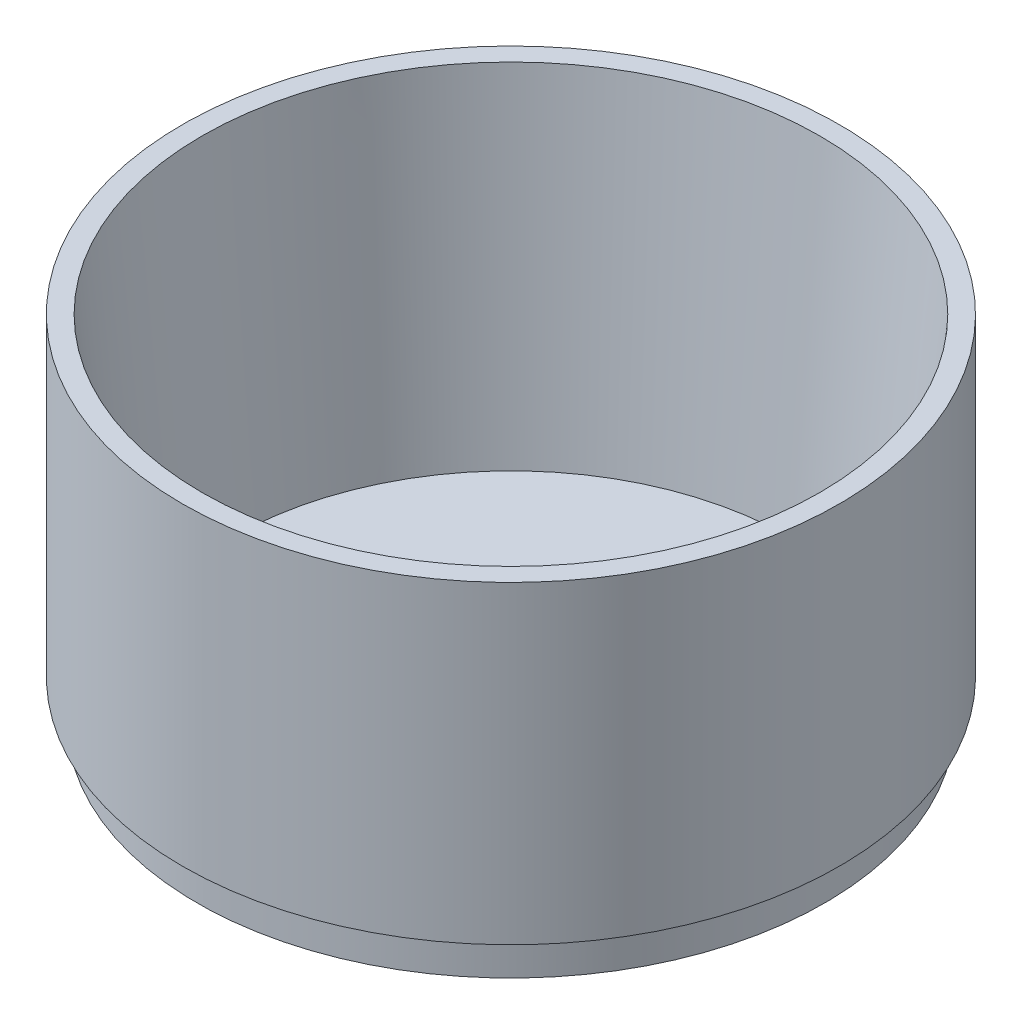
ISO-10303-21;
HEADER;
FILE_DESCRIPTION(('STEP AP214'),'2;1');
FILE_NAME('part.step','',(''),(''),'','','');
FILE_SCHEMA(('AUTOMOTIVE_DESIGN { 1 0 10303 214 1 1 1 1 }'));
ENDSEC;
DATA;
#1=APPLICATION_CONTEXT('core data for automotive mechanical design processes');
#2=APPLICATION_PROTOCOL_DEFINITION('international standard','automotive_design',2000,#1);
#3=PRODUCT_CONTEXT('',#1,'mechanical');
#4=PRODUCT('Part','Part','',(#3));
#5=PRODUCT_RELATED_PRODUCT_CATEGORY('part','',(#4));
#6=PRODUCT_DEFINITION_FORMATION('','',#4);
#7=PRODUCT_DEFINITION_CONTEXT('part definition',#1,'design');
#8=PRODUCT_DEFINITION('design','',#6,#7);
#9=PRODUCT_DEFINITION_SHAPE('','',#8);
#10=(LENGTH_UNIT() NAMED_UNIT(*) SI_UNIT(.MILLI.,.METRE.));
#11=(NAMED_UNIT(*) PLANE_ANGLE_UNIT() SI_UNIT($,.RADIAN.));
#12=(NAMED_UNIT(*) SI_UNIT($,.STERADIAN.) SOLID_ANGLE_UNIT());
#13=UNCERTAINTY_MEASURE_WITH_UNIT(LENGTH_MEASURE(1.E-05),#10,'distance_accuracy_value','');
#14=(GEOMETRIC_REPRESENTATION_CONTEXT(3) GLOBAL_UNCERTAINTY_ASSIGNED_CONTEXT((#13)) GLOBAL_UNIT_ASSIGNED_CONTEXT((#10,
#11,#12)) REPRESENTATION_CONTEXT('',''));
#15=CARTESIAN_POINT('',(0.,0.,0.));
#16=DIRECTION('',(0.,0.,1.));
#17=DIRECTION('',(1.,0.,0.));
#18=AXIS2_PLACEMENT_3D('',#15,#16,#17);
#19=CARTESIAN_POINT('',(0.,50.8,0.));
#20=DIRECTION('',(0.,-1.,0.));
#21=DIRECTION('',(0.,0.,-1.));
#22=AXIS2_PLACEMENT_3D('',#19,#20,#21);
#23=CYLINDRICAL_SURFACE('',#22,53.18125);
#24=CARTESIAN_POINT('',(0.,50.8,0.));
#25=DIRECTION('',(0.,1.,0.));
#26=DIRECTION('',(0.,0.,1.));
#27=AXIS2_PLACEMENT_3D('',#24,#25,#26);
#28=CIRCLE('',#27,53.18125);
#29=CARTESIAN_POINT('',(0.,50.8,53.18125));
#30=VERTEX_POINT('',#29);
#31=EDGE_CURVE('E52',#30,#30,#28,.T.);
#32=ORIENTED_EDGE('',*,*,#31,.F.);
#33=EDGE_LOOP('',(#32));
#34=FACE_BOUND('',#33,.T.);
#35=CARTESIAN_POINT('',(0.,0.,0.));
#36=DIRECTION('',(0.,1.,0.));
#37=DIRECTION('',(0.,0.,1.));
#38=AXIS2_PLACEMENT_3D('',#35,#36,#37);
#39=CIRCLE('',#38,53.18125);
#40=CARTESIAN_POINT('',(0.,0.,53.18125));
#41=VERTEX_POINT('',#40);
#42=EDGE_CURVE('E48',#41,#41,#39,.T.);
#43=ORIENTED_EDGE('',*,*,#42,.T.);
#44=EDGE_LOOP('',(#43));
#45=FACE_BOUND('',#44,.T.);
#46=ADVANCED_FACE('F45',(#34,#45),#23,.T.);
#47=CARTESIAN_POINT('',(0.,50.8,0.));
#48=DIRECTION('',(0.,1.,0.));
#49=DIRECTION('',(0.,0.,1.));
#50=AXIS2_PLACEMENT_3D('',#47,#48,#49);
#51=PLANE('',#50);
#52=CARTESIAN_POINT('',(0.,50.8,0.));
#53=DIRECTION('',(0.,1.,0.));
#54=DIRECTION('',(0.,0.,1.));
#55=AXIS2_PLACEMENT_3D('',#52,#53,#54);
#56=CIRCLE('',#55,50.00625);
#57=CARTESIAN_POINT('',(0.,50.8,50.00625));
#58=VERTEX_POINT('',#57);
#59=EDGE_CURVE('E64',#58,#58,#56,.T.);
#60=ORIENTED_EDGE('',*,*,#59,.F.);
#61=EDGE_LOOP('',(#60));
#62=FACE_BOUND('',#61,.T.);
#63=ORIENTED_EDGE('',*,*,#31,.T.);
#64=EDGE_LOOP('',(#63));
#65=FACE_BOUND('',#64,.T.);
#66=ADVANCED_FACE('F112',(#62,#65),#51,.T.);
#67=CARTESIAN_POINT('',(0.,0.,0.));
#68=DIRECTION('',(0.,1.,0.));
#69=DIRECTION('',(0.,0.,1.));
#70=AXIS2_PLACEMENT_3D('',#67,#68,#69);
#71=PLANE('',#70);
#72=CARTESIAN_POINT('',(0.,0.,0.));
#73=DIRECTION('',(0.,-1.,0.));
#74=DIRECTION('',(0.,0.,-1.));
#75=AXIS2_PLACEMENT_3D('',#72,#73,#74);
#76=CIRCLE('',#75,50.8);
#77=CARTESIAN_POINT('',(0.,0.,-50.8));
#78=VERTEX_POINT('',#77);
#79=EDGE_CURVE('E11',#78,#78,#76,.T.);
#80=ORIENTED_EDGE('',*,*,#79,.F.);
#81=EDGE_LOOP('',(#80));
#82=FACE_BOUND('',#81,.T.);
#83=ORIENTED_EDGE('',*,*,#42,.F.);
#84=EDGE_LOOP('',(#83));
#85=FACE_BOUND('',#84,.T.);
#86=ADVANCED_FACE('F117',(#82,#85),#71,.F.);
#87=CARTESIAN_POINT('',(0.,-6.35,0.));
#88=DIRECTION('',(0.,1.,0.));
#89=DIRECTION('',(0.,0.,1.));
#90=AXIS2_PLACEMENT_3D('',#87,#88,#89);
#91=CYLINDRICAL_SURFACE('',#90,50.8);
#92=CARTESIAN_POINT('',(0.,-6.35,0.));
#93=DIRECTION('',(0.,-1.,0.));
#94=DIRECTION('',(0.,0.,-1.));
#95=AXIS2_PLACEMENT_3D('',#92,#93,#94);
#96=CIRCLE('',#95,50.8);
#97=CARTESIAN_POINT('',(0.,-6.35,-50.8));
#98=VERTEX_POINT('',#97);
#99=EDGE_CURVE('E58',#98,#98,#96,.T.);
#100=ORIENTED_EDGE('',*,*,#99,.F.);
#101=EDGE_LOOP('',(#100));
#102=FACE_BOUND('',#101,.T.);
#103=ORIENTED_EDGE('',*,*,#79,.T.);
#104=EDGE_LOOP('',(#103));
#105=FACE_BOUND('',#104,.T.);
#106=ADVANCED_FACE('F126',(#102,#105),#91,.T.);
#107=CARTESIAN_POINT('',(0.,-6.35,0.));
#108=DIRECTION('',(0.,-1.,0.));
#109=DIRECTION('',(0.,0.,-1.));
#110=AXIS2_PLACEMENT_3D('',#107,#108,#109);
#111=PLANE('',#110);
#112=CARTESIAN_POINT('',(7.48713179512813,-6.35,15.7759869337034));
#113=DIRECTION('',(0.,-1.,0.));
#114=DIRECTION('',(0.,0.,-1.));
#115=AXIS2_PLACEMENT_3D('',#112,#113,#114);
#116=CIRCLE('',#115,4.7625);
#117=CARTESIAN_POINT('',(7.48713179512813,-6.35,11.0134869337034));
#118=VERTEX_POINT('',#117);
#119=EDGE_CURVE('E67',#118,#118,#116,.F.);
#120=ORIENTED_EDGE('',*,*,#119,.T.);
#121=EDGE_LOOP('',(#120));
#122=FACE_BOUND('',#121,.T.);
#123=CARTESIAN_POINT('',(1.2743573258838E-13,-6.35,0.));
#124=DIRECTION('',(0.,-1.,0.));
#125=DIRECTION('',(0.,0.,-1.));
#126=AXIS2_PLACEMENT_3D('',#123,#124,#125);
#127=CIRCLE('',#126,4.7625);
#128=CARTESIAN_POINT('',(1.2743573258838E-13,-6.35,-4.76250000000004));
#129=VERTEX_POINT('',#128);
#130=EDGE_CURVE('E75',#129,#129,#127,.F.);
#131=ORIENTED_EDGE('',*,*,#130,.T.);
#132=EDGE_LOOP('',(#131));
#133=FACE_BOUND('',#132,.T.);
#134=CARTESIAN_POINT('',(-7.48713179512813,-6.35,-15.7759869337034));
#135=DIRECTION('',(0.,-1.,0.));
#136=DIRECTION('',(0.,0.,-1.));
#137=AXIS2_PLACEMENT_3D('',#134,#135,#136);
#138=CIRCLE('',#137,4.7625);
#139=CARTESIAN_POINT('',(-7.48713179512813,-6.35,-20.5384869337034));
#140=VERTEX_POINT('',#139);
#141=EDGE_CURVE('E68',#140,#140,#138,.F.);
#142=ORIENTED_EDGE('',*,*,#141,.T.);
#143=EDGE_LOOP('',(#142));
#144=FACE_BOUND('',#143,.T.);
#145=ORIENTED_EDGE('',*,*,#99,.T.);
#146=EDGE_LOOP('',(#145));
#147=FACE_BOUND('',#146,.T.);
#148=ADVANCED_FACE('F93',(#122,#133,#144,#147),#111,.T.);
#149=CARTESIAN_POINT('',(0.,-3.175,0.));
#150=DIRECTION('',(0.,-1.,0.));
#151=DIRECTION('',(0.,0.,-1.));
#152=AXIS2_PLACEMENT_3D('',#149,#150,#151);
#153=PLANE('',#152);
#154=CARTESIAN_POINT('',(7.48713179512813,-3.175,15.7759869337034));
#155=DIRECTION('',(0.,1.,0.));
#156=DIRECTION('',(0.,0.,1.));
#157=AXIS2_PLACEMENT_3D('',#154,#155,#156);
#158=CIRCLE('',#157,4.7625);
#159=CARTESIAN_POINT('',(7.48713179512813,-3.175,20.5384869337034));
#160=VERTEX_POINT('',#159);
#161=EDGE_CURVE('E78',#160,#160,#158,.T.);
#162=ORIENTED_EDGE('',*,*,#161,.F.);
#163=EDGE_LOOP('',(#162));
#164=FACE_BOUND('',#163,.T.);
#165=CARTESIAN_POINT('',(1.2743573258838E-13,-3.175,0.));
#166=DIRECTION('',(0.,1.,0.));
#167=DIRECTION('',(0.,0.,1.));
#168=AXIS2_PLACEMENT_3D('',#165,#166,#167);
#169=CIRCLE('',#168,4.7625);
#170=CARTESIAN_POINT('',(1.2743573258838E-13,-3.175,4.76249999999996));
#171=VERTEX_POINT('',#170);
#172=EDGE_CURVE('E71',#171,#171,#169,.T.);
#173=ORIENTED_EDGE('',*,*,#172,.F.);
#174=EDGE_LOOP('',(#173));
#175=FACE_BOUND('',#174,.T.);
#176=CARTESIAN_POINT('',(-7.48713179512813,-3.175,-15.7759869337034));
#177=DIRECTION('',(0.,1.,0.));
#178=DIRECTION('',(0.,0.,1.));
#179=AXIS2_PLACEMENT_3D('',#176,#177,#178);
#180=CIRCLE('',#179,4.7625);
#181=CARTESIAN_POINT('',(-7.48713179512813,-3.175,-11.0134869337034));
#182=VERTEX_POINT('',#181);
#183=EDGE_CURVE('E72',#182,#182,#180,.T.);
#184=ORIENTED_EDGE('',*,*,#183,.F.);
#185=EDGE_LOOP('',(#184));
#186=FACE_BOUND('',#185,.T.);
#187=CARTESIAN_POINT('',(0.,-3.175,0.));
#188=DIRECTION('',(0.,-1.,0.));
#189=DIRECTION('',(0.,0.,-1.));
#190=AXIS2_PLACEMENT_3D('',#187,#188,#189);
#191=CIRCLE('',#190,45.2840493861882);
#192=CARTESIAN_POINT('',(0.,-3.175,-45.2840493861882));
#193=VERTEX_POINT('',#192);
#194=EDGE_CURVE('E61',#193,#193,#191,.F.);
#195=ORIENTED_EDGE('',*,*,#194,.T.);
#196=EDGE_LOOP('',(#195));
#197=FACE_BOUND('',#196,.T.);
#198=ADVANCED_FACE('F89',(#164,#175,#186,#197),#153,.F.);
#199=CARTESIAN_POINT('',(0.,50.8,0.));
#200=DIRECTION('',(0.,1.,0.));
#201=DIRECTION('',(0.,0.,1.));
#202=AXIS2_PLACEMENT_3D('',#199,#200,#201);
#203=CONICAL_SURFACE('',#202,50.00625,0.0872664625997165);
#204=ORIENTED_EDGE('',*,*,#59,.T.);
#205=EDGE_LOOP('',(#204));
#206=FACE_BOUND('',#205,.T.);
#207=ORIENTED_EDGE('',*,*,#194,.F.);
#208=EDGE_LOOP('',(#207));
#209=FACE_BOUND('',#208,.T.);
#210=ADVANCED_FACE('F92',(#206,#209),#203,.F.);
#211=CARTESIAN_POINT('',(-7.48713179512813,-19.8203841816037,-15.7759869337034));
#212=DIRECTION('',(0.,1.,0.));
#213=DIRECTION('',(0.,0.,1.));
#214=AXIS2_PLACEMENT_3D('',#211,#212,#213);
#215=CYLINDRICAL_SURFACE('',#214,4.7625);
#216=ORIENTED_EDGE('',*,*,#183,.T.);
#217=EDGE_LOOP('',(#216));
#218=FACE_BOUND('',#217,.T.);
#219=ORIENTED_EDGE('',*,*,#141,.F.);
#220=EDGE_LOOP('',(#219));
#221=FACE_BOUND('',#220,.T.);
#222=ADVANCED_FACE('F102',(#218,#221),#215,.F.);
#223=CARTESIAN_POINT('',(1.2743573258838E-13,-19.8203841816037,0.));
#224=DIRECTION('',(0.,1.,0.));
#225=DIRECTION('',(0.,0.,1.));
#226=AXIS2_PLACEMENT_3D('',#223,#224,#225);
#227=CYLINDRICAL_SURFACE('',#226,4.7625);
#228=ORIENTED_EDGE('',*,*,#172,.T.);
#229=EDGE_LOOP('',(#228));
#230=FACE_BOUND('',#229,.T.);
#231=ORIENTED_EDGE('',*,*,#130,.F.);
#232=EDGE_LOOP('',(#231));
#233=FACE_BOUND('',#232,.T.);
#234=ADVANCED_FACE('F108',(#230,#233),#227,.F.);
#235=CARTESIAN_POINT('',(7.48713179512813,-19.8203841816037,15.7759869337034));
#236=DIRECTION('',(0.,1.,0.));
#237=DIRECTION('',(0.,0.,1.));
#238=AXIS2_PLACEMENT_3D('',#235,#236,#237);
#239=CYLINDRICAL_SURFACE('',#238,4.7625);
#240=ORIENTED_EDGE('',*,*,#161,.T.);
#241=EDGE_LOOP('',(#240));
#242=FACE_BOUND('',#241,.T.);
#243=ORIENTED_EDGE('',*,*,#119,.F.);
#244=EDGE_LOOP('',(#243));
#245=FACE_BOUND('',#244,.T.);
#246=ADVANCED_FACE('F86',(#242,#245),#239,.F.);
#247=CLOSED_SHELL('',(#46,#66,#86,#106,#148,#198,#210,#222,#234,#246));
#248=MANIFOLD_SOLID_BREP('B2',#247);
#249=ADVANCED_BREP_SHAPE_REPRESENTATION('',(#18,#248),#14);
#250=SHAPE_DEFINITION_REPRESENTATION(#9,#249);
ENDSEC;
END-ISO-10303-21;
